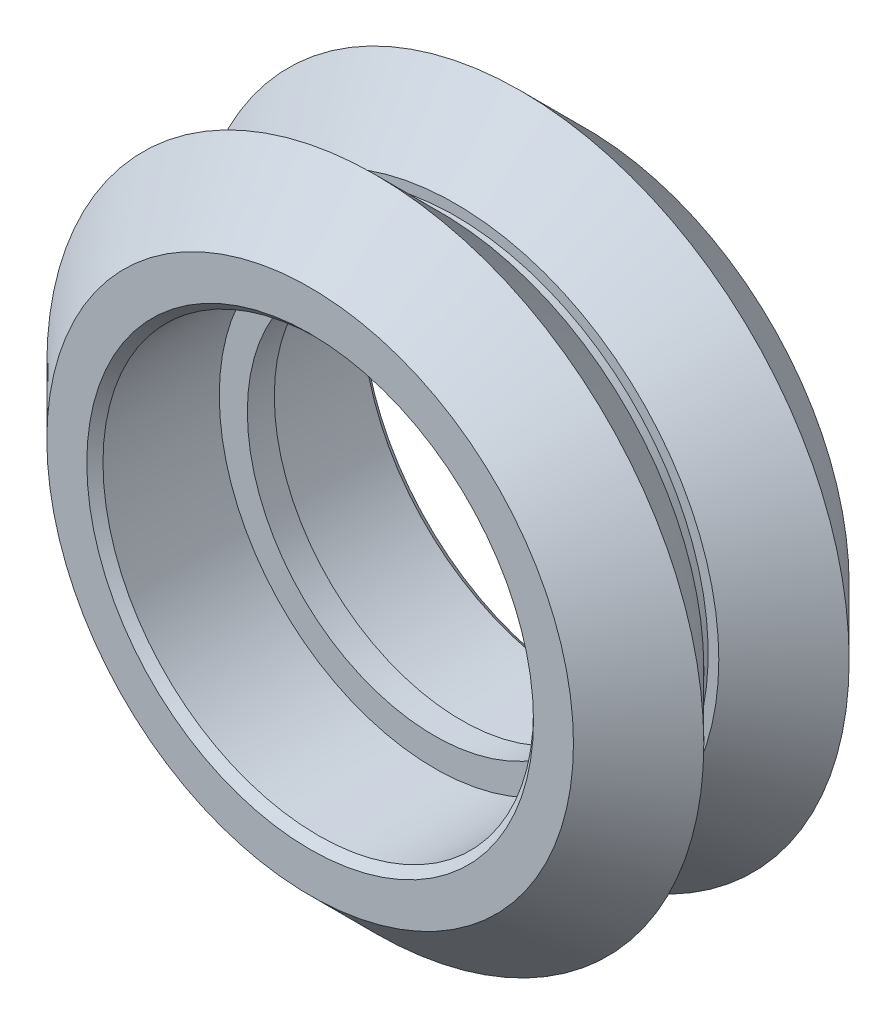
ISO-10303-21;
HEADER;
FILE_DESCRIPTION(('STEP AP214'),'2;1');
FILE_NAME('part.step','',(''),(''),'','','');
FILE_SCHEMA(('AUTOMOTIVE_DESIGN { 1 0 10303 214 1 1 1 1 }'));
ENDSEC;
DATA;
#1=APPLICATION_CONTEXT('core data for automotive mechanical design processes');
#2=APPLICATION_PROTOCOL_DEFINITION('international standard','automotive_design',2000,#1);
#3=PRODUCT_CONTEXT('',#1,'mechanical');
#4=PRODUCT('Part','Part','',(#3));
#5=PRODUCT_RELATED_PRODUCT_CATEGORY('part','',(#4));
#6=PRODUCT_DEFINITION_FORMATION('','',#4);
#7=PRODUCT_DEFINITION_CONTEXT('part definition',#1,'design');
#8=PRODUCT_DEFINITION('design','',#6,#7);
#9=PRODUCT_DEFINITION_SHAPE('','',#8);
#10=(LENGTH_UNIT() NAMED_UNIT(*) SI_UNIT(.MILLI.,.METRE.));
#11=(NAMED_UNIT(*) PLANE_ANGLE_UNIT() SI_UNIT($,.RADIAN.));
#12=(NAMED_UNIT(*) SI_UNIT($,.STERADIAN.) SOLID_ANGLE_UNIT());
#13=UNCERTAINTY_MEASURE_WITH_UNIT(LENGTH_MEASURE(1.E-05),#10,'distance_accuracy_value','');
#14=(GEOMETRIC_REPRESENTATION_CONTEXT(3) GLOBAL_UNCERTAINTY_ASSIGNED_CONTEXT((#13)) GLOBAL_UNIT_ASSIGNED_CONTEXT((#10,
#11,#12)) REPRESENTATION_CONTEXT('',''));
#15=CARTESIAN_POINT('',(0.,0.,0.));
#16=DIRECTION('',(0.,0.,1.));
#17=DIRECTION('',(1.,0.,0.));
#18=AXIS2_PLACEMENT_3D('',#15,#16,#17);
#19=CARTESIAN_POINT('',(0.,0.,-5.115));
#20=DIRECTION('',(0.,0.,-1.));
#21=DIRECTION('',(-1.,0.,0.));
#22=AXIS2_PLACEMENT_3D('',#19,#20,#21);
#23=CYLINDRICAL_SURFACE('',#22,7.987);
#24=CARTESIAN_POINT('',(0.,0.,4.815));
#25=DIRECTION('',(0.,0.,1.));
#26=DIRECTION('',(1.,0.,0.));
#27=AXIS2_PLACEMENT_3D('',#24,#25,#26);
#28=CIRCLE('',#27,7.987);
#29=CARTESIAN_POINT('',(7.987,0.,4.815));
#30=VERTEX_POINT('',#29);
#31=EDGE_CURVE('E42',#30,#30,#28,.T.);
#32=ORIENTED_EDGE('',*,*,#31,.T.);
#33=EDGE_LOOP('',(#32));
#34=FACE_BOUND('',#33,.T.);
#35=CARTESIAN_POINT('',(0.,0.,0.5));
#36=DIRECTION('',(0.,0.,-1.));
#37=DIRECTION('',(-1.,0.,0.));
#38=AXIS2_PLACEMENT_3D('',#35,#36,#37);
#39=CIRCLE('',#38,7.987);
#40=CARTESIAN_POINT('',(-7.987,0.,0.5));
#41=VERTEX_POINT('',#40);
#42=EDGE_CURVE('E51',#41,#41,#39,.T.);
#43=ORIENTED_EDGE('',*,*,#42,.T.);
#44=EDGE_LOOP('',(#43));
#45=FACE_BOUND('',#44,.T.);
#46=ADVANCED_FACE('F31',(#34,#45),#23,.F.);
#47=CARTESIAN_POINT('',(0.,0.,0.5));
#48=DIRECTION('',(0.,0.,-1.));
#49=DIRECTION('',(-1.,0.,0.));
#50=AXIS2_PLACEMENT_3D('',#47,#48,#49);
#51=PLANE('',#50);
#52=ORIENTED_EDGE('',*,*,#42,.F.);
#53=EDGE_LOOP('',(#52));
#54=FACE_BOUND('',#53,.T.);
#55=CARTESIAN_POINT('',(0.,0.,0.5));
#56=DIRECTION('',(0.,0.,-1.));
#57=DIRECTION('',(-1.,0.,0.));
#58=AXIS2_PLACEMENT_3D('',#55,#56,#57);
#59=CIRCLE('',#58,6.945);
#60=CARTESIAN_POINT('',(-6.945,0.,0.5));
#61=VERTEX_POINT('',#60);
#62=EDGE_CURVE('E54',#61,#61,#59,.T.);
#63=ORIENTED_EDGE('',*,*,#62,.T.);
#64=EDGE_LOOP('',(#63));
#65=FACE_BOUND('',#64,.T.);
#66=ADVANCED_FACE('F104',(#54,#65),#51,.F.);
#67=CARTESIAN_POINT('',(0.,0.,-5.115));
#68=DIRECTION('',(0.,0.,-1.));
#69=DIRECTION('',(-1.,0.,0.));
#70=AXIS2_PLACEMENT_3D('',#67,#68,#69);
#71=CYLINDRICAL_SURFACE('',#70,6.945);
#72=ORIENTED_EDGE('',*,*,#62,.F.);
#73=EDGE_LOOP('',(#72));
#74=FACE_BOUND('',#73,.T.);
#75=CARTESIAN_POINT('',(0.,0.,-0.5));
#76=DIRECTION('',(0.,0.,-1.));
#77=DIRECTION('',(-1.,0.,0.));
#78=AXIS2_PLACEMENT_3D('',#75,#76,#77);
#79=CIRCLE('',#78,6.945);
#80=CARTESIAN_POINT('',(-6.945,0.,-0.5));
#81=VERTEX_POINT('',#80);
#82=EDGE_CURVE('E57',#81,#81,#79,.T.);
#83=ORIENTED_EDGE('',*,*,#82,.T.);
#84=EDGE_LOOP('',(#83));
#85=FACE_BOUND('',#84,.T.);
#86=ADVANCED_FACE('F110',(#74,#85),#71,.F.);
#87=CARTESIAN_POINT('',(0.,0.,-0.5));
#88=DIRECTION('',(0.,0.,1.));
#89=DIRECTION('',(1.,0.,0.));
#90=AXIS2_PLACEMENT_3D('',#87,#88,#89);
#91=PLANE('',#90);
#92=ORIENTED_EDGE('',*,*,#82,.F.);
#93=EDGE_LOOP('',(#92));
#94=FACE_BOUND('',#93,.T.);
#95=CARTESIAN_POINT('',(0.,0.,-0.5));
#96=DIRECTION('',(0.,0.,-1.));
#97=DIRECTION('',(-1.,0.,0.));
#98=AXIS2_PLACEMENT_3D('',#95,#96,#97);
#99=CIRCLE('',#98,7.987);
#100=CARTESIAN_POINT('',(-7.987,0.,-0.5));
#101=VERTEX_POINT('',#100);
#102=EDGE_CURVE('E60',#101,#101,#99,.T.);
#103=ORIENTED_EDGE('',*,*,#102,.T.);
#104=EDGE_LOOP('',(#103));
#105=FACE_BOUND('',#104,.T.);
#106=ADVANCED_FACE('F117',(#94,#105),#91,.F.);
#107=CARTESIAN_POINT('',(0.,0.,-5.115));
#108=DIRECTION('',(0.,0.,-1.));
#109=DIRECTION('',(-1.,0.,0.));
#110=AXIS2_PLACEMENT_3D('',#107,#108,#109);
#111=CYLINDRICAL_SURFACE('',#110,7.987);
#112=CARTESIAN_POINT('',(0.,0.,-4.815));
#113=DIRECTION('',(0.,0.,-1.));
#114=DIRECTION('',(-1.,0.,0.));
#115=AXIS2_PLACEMENT_3D('',#112,#113,#114);
#116=CIRCLE('',#115,7.987);
#117=CARTESIAN_POINT('',(-7.987,0.,-4.815));
#118=VERTEX_POINT('',#117);
#119=EDGE_CURVE('E38',#118,#118,#116,.T.);
#120=ORIENTED_EDGE('',*,*,#119,.T.);
#121=EDGE_LOOP('',(#120));
#122=FACE_BOUND('',#121,.T.);
#123=ORIENTED_EDGE('',*,*,#102,.F.);
#124=EDGE_LOOP('',(#123));
#125=FACE_BOUND('',#124,.T.);
#126=ADVANCED_FACE('F121',(#122,#125),#111,.F.);
#127=CARTESIAN_POINT('',(0.,0.,-5.115));
#128=DIRECTION('',(0.,0.,-1.));
#129=DIRECTION('',(-1.,0.,0.));
#130=AXIS2_PLACEMENT_3D('',#127,#128,#129);
#131=PLANE('',#130);
#132=CARTESIAN_POINT('',(0.,0.,-5.115));
#133=DIRECTION('',(0.,0.,-1.));
#134=DIRECTION('',(-1.,0.,0.));
#135=AXIS2_PLACEMENT_3D('',#132,#133,#134);
#136=CIRCLE('',#135,8.287);
#137=CARTESIAN_POINT('',(-8.287,0.,-5.115));
#138=VERTEX_POINT('',#137);
#139=EDGE_CURVE('E10',#138,#138,#136,.F.);
#140=ORIENTED_EDGE('',*,*,#139,.T.);
#141=EDGE_LOOP('',(#140));
#142=FACE_BOUND('',#141,.T.);
#143=CARTESIAN_POINT('',(0.,0.,-5.115));
#144=DIRECTION('',(0.,0.,-1.));
#145=DIRECTION('',(-1.,0.,0.));
#146=AXIS2_PLACEMENT_3D('',#143,#144,#145);
#147=CIRCLE('',#146,9.77);
#148=CARTESIAN_POINT('',(-9.77,0.,-5.115));
#149=VERTEX_POINT('',#148);
#150=EDGE_CURVE('E63',#149,#149,#147,.T.);
#151=ORIENTED_EDGE('',*,*,#150,.T.);
#152=EDGE_LOOP('',(#151));
#153=FACE_BOUND('',#152,.T.);
#154=ADVANCED_FACE('F125',(#142,#153),#131,.T.);
#155=CARTESIAN_POINT('',(0.,0.,-5.115));
#156=DIRECTION('',(0.,0.,1.));
#157=DIRECTION('',(1.,0.,0.));
#158=AXIS2_PLACEMENT_3D('',#155,#156,#157);
#159=CONICAL_SURFACE('',#158,9.77,0.785398163397449);
#160=CARTESIAN_POINT('',(0.,0.,-2.69669480834201));
#161=DIRECTION('',(0.,0.,-1.));
#162=DIRECTION('',(-1.,0.,0.));
#163=AXIS2_PLACEMENT_3D('',#160,#161,#162);
#164=CIRCLE('',#163,12.188305191658);
#165=CARTESIAN_POINT('',(-12.188305191658,0.,-2.69669480834201));
#166=VERTEX_POINT('',#165);
#167=EDGE_CURVE('E66',#166,#166,#164,.T.);
#168=ORIENTED_EDGE('',*,*,#167,.T.);
#169=EDGE_LOOP('',(#168));
#170=FACE_BOUND('',#169,.T.);
#171=ORIENTED_EDGE('',*,*,#150,.F.);
#172=EDGE_LOOP('',(#171));
#173=FACE_BOUND('',#172,.T.);
#174=ADVANCED_FACE('F128',(#170,#173),#159,.T.);
#175=CARTESIAN_POINT('',(0.,0.,-2.69669480834201));
#176=DIRECTION('',(0.,0.,-1.));
#177=DIRECTION('',(-1.,0.,0.));
#178=AXIS2_PLACEMENT_3D('',#175,#176,#177);
#179=CONICAL_SURFACE('',#178,12.188305191658,0.78539816339745);
#180=CARTESIAN_POINT('',(0.,0.,-0.278389616684021));
#181=DIRECTION('',(0.,0.,-1.));
#182=DIRECTION('',(-1.,0.,0.));
#183=AXIS2_PLACEMENT_3D('',#180,#181,#182);
#184=CIRCLE('',#183,9.77);
#185=CARTESIAN_POINT('',(-9.77,0.,-0.278389616684021));
#186=VERTEX_POINT('',#185);
#187=EDGE_CURVE('E69',#186,#186,#184,.T.);
#188=ORIENTED_EDGE('',*,*,#187,.T.);
#189=EDGE_LOOP('',(#188));
#190=FACE_BOUND('',#189,.T.);
#191=ORIENTED_EDGE('',*,*,#167,.F.);
#192=EDGE_LOOP('',(#191));
#193=FACE_BOUND('',#192,.T.);
#194=ADVANCED_FACE('F131',(#190,#193),#179,.T.);
#195=CARTESIAN_POINT('',(0.,0.,-0.278389616684021));
#196=DIRECTION('',(0.,0.,1.));
#197=DIRECTION('',(1.,0.,0.));
#198=AXIS2_PLACEMENT_3D('',#195,#196,#197);
#199=PLANE('',#198);
#200=CARTESIAN_POINT('',(0.,0.,-0.278389616684021));
#201=DIRECTION('',(0.,0.,-1.));
#202=DIRECTION('',(-1.,0.,0.));
#203=AXIS2_PLACEMENT_3D('',#200,#201,#202);
#204=CIRCLE('',#203,9.375);
#205=CARTESIAN_POINT('',(-9.375,0.,-0.278389616684021));
#206=VERTEX_POINT('',#205);
#207=EDGE_CURVE('E72',#206,#206,#204,.T.);
#208=ORIENTED_EDGE('',*,*,#207,.T.);
#209=EDGE_LOOP('',(#208));
#210=FACE_BOUND('',#209,.T.);
#211=ORIENTED_EDGE('',*,*,#187,.F.);
#212=EDGE_LOOP('',(#211));
#213=FACE_BOUND('',#212,.T.);
#214=ADVANCED_FACE('F135',(#210,#213),#199,.T.);
#215=CARTESIAN_POINT('',(0.,0.,-5.115));
#216=DIRECTION('',(0.,0.,-1.));
#217=DIRECTION('',(-1.,0.,0.));
#218=AXIS2_PLACEMENT_3D('',#215,#216,#217);
#219=CYLINDRICAL_SURFACE('',#218,9.375);
#220=CARTESIAN_POINT('',(0.,0.,0.278389616684021));
#221=DIRECTION('',(0.,0.,-1.));
#222=DIRECTION('',(-1.,0.,0.));
#223=AXIS2_PLACEMENT_3D('',#220,#221,#222);
#224=CIRCLE('',#223,9.375);
#225=CARTESIAN_POINT('',(-9.375,0.,0.278389616684021));
#226=VERTEX_POINT('',#225);
#227=EDGE_CURVE('E75',#226,#226,#224,.T.);
#228=ORIENTED_EDGE('',*,*,#227,.T.);
#229=EDGE_LOOP('',(#228));
#230=FACE_BOUND('',#229,.T.);
#231=ORIENTED_EDGE('',*,*,#207,.F.);
#232=EDGE_LOOP('',(#231));
#233=FACE_BOUND('',#232,.T.);
#234=ADVANCED_FACE('F139',(#230,#233),#219,.T.);
#235=CARTESIAN_POINT('',(0.,0.,0.278389616684021));
#236=DIRECTION('',(0.,0.,-1.));
#237=DIRECTION('',(-1.,0.,0.));
#238=AXIS2_PLACEMENT_3D('',#235,#236,#237);
#239=PLANE('',#238);
#240=CARTESIAN_POINT('',(0.,0.,0.278389616684021));
#241=DIRECTION('',(0.,0.,-1.));
#242=DIRECTION('',(-1.,0.,0.));
#243=AXIS2_PLACEMENT_3D('',#240,#241,#242);
#244=CIRCLE('',#243,9.77);
#245=CARTESIAN_POINT('',(-9.77,0.,0.278389616684021));
#246=VERTEX_POINT('',#245);
#247=EDGE_CURVE('E78',#246,#246,#244,.T.);
#248=ORIENTED_EDGE('',*,*,#247,.T.);
#249=EDGE_LOOP('',(#248));
#250=FACE_BOUND('',#249,.T.);
#251=ORIENTED_EDGE('',*,*,#227,.F.);
#252=EDGE_LOOP('',(#251));
#253=FACE_BOUND('',#252,.T.);
#254=ADVANCED_FACE('F143',(#250,#253),#239,.T.);
#255=CARTESIAN_POINT('',(0.,0.,0.278389616684021));
#256=DIRECTION('',(0.,0.,1.));
#257=DIRECTION('',(1.,0.,0.));
#258=AXIS2_PLACEMENT_3D('',#255,#256,#257);
#259=CONICAL_SURFACE('',#258,9.77,0.78539816339745);
#260=CARTESIAN_POINT('',(0.,0.,2.69669480834201));
#261=DIRECTION('',(0.,0.,-1.));
#262=DIRECTION('',(-1.,0.,0.));
#263=AXIS2_PLACEMENT_3D('',#260,#261,#262);
#264=CIRCLE('',#263,12.188305191658);
#265=CARTESIAN_POINT('',(-12.188305191658,0.,2.69669480834201));
#266=VERTEX_POINT('',#265);
#267=EDGE_CURVE('E81',#266,#266,#264,.T.);
#268=ORIENTED_EDGE('',*,*,#267,.T.);
#269=EDGE_LOOP('',(#268));
#270=FACE_BOUND('',#269,.T.);
#271=ORIENTED_EDGE('',*,*,#247,.F.);
#272=EDGE_LOOP('',(#271));
#273=FACE_BOUND('',#272,.T.);
#274=ADVANCED_FACE('F101',(#270,#273),#259,.T.);
#275=CARTESIAN_POINT('',(0.,0.,2.69669480834201));
#276=DIRECTION('',(0.,0.,-1.));
#277=DIRECTION('',(-1.,0.,0.));
#278=AXIS2_PLACEMENT_3D('',#275,#276,#277);
#279=CONICAL_SURFACE('',#278,12.188305191658,0.785398163397449);
#280=CARTESIAN_POINT('',(0.,0.,5.115));
#281=DIRECTION('',(0.,0.,-1.));
#282=DIRECTION('',(-1.,0.,0.));
#283=AXIS2_PLACEMENT_3D('',#280,#281,#282);
#284=CIRCLE('',#283,9.77);
#285=CARTESIAN_POINT('',(-9.77,0.,5.115));
#286=VERTEX_POINT('',#285);
#287=EDGE_CURVE('E84',#286,#286,#284,.T.);
#288=ORIENTED_EDGE('',*,*,#287,.T.);
#289=EDGE_LOOP('',(#288));
#290=FACE_BOUND('',#289,.T.);
#291=ORIENTED_EDGE('',*,*,#267,.F.);
#292=EDGE_LOOP('',(#291));
#293=FACE_BOUND('',#292,.T.);
#294=ADVANCED_FACE('F88',(#290,#293),#279,.T.);
#295=CARTESIAN_POINT('',(0.,0.,5.115));
#296=DIRECTION('',(0.,0.,1.));
#297=DIRECTION('',(1.,0.,0.));
#298=AXIS2_PLACEMENT_3D('',#295,#296,#297);
#299=PLANE('',#298);
#300=CARTESIAN_POINT('',(0.,0.,5.115));
#301=DIRECTION('',(0.,0.,1.));
#302=DIRECTION('',(1.,0.,0.));
#303=AXIS2_PLACEMENT_3D('',#300,#301,#302);
#304=CIRCLE('',#303,8.28699999999999);
#305=CARTESIAN_POINT('',(8.28699999999999,0.,5.115));
#306=VERTEX_POINT('',#305);
#307=EDGE_CURVE('E46',#306,#306,#304,.F.);
#308=ORIENTED_EDGE('',*,*,#307,.T.);
#309=EDGE_LOOP('',(#308));
#310=FACE_BOUND('',#309,.T.);
#311=ORIENTED_EDGE('',*,*,#287,.F.);
#312=EDGE_LOOP('',(#311));
#313=FACE_BOUND('',#312,.T.);
#314=ADVANCED_FACE('F91',(#310,#313),#299,.T.);
#315=CARTESIAN_POINT('',(0.,0.,5.115));
#316=DIRECTION('',(0.,0.,1.));
#317=DIRECTION('',(1.,0.,0.));
#318=AXIS2_PLACEMENT_3D('',#315,#316,#317);
#319=CONICAL_SURFACE('',#318,8.28699999999999,0.78539816339744);
#320=ORIENTED_EDGE('',*,*,#31,.F.);
#321=EDGE_LOOP('',(#320));
#322=FACE_BOUND('',#321,.T.);
#323=ORIENTED_EDGE('',*,*,#307,.F.);
#324=EDGE_LOOP('',(#323));
#325=FACE_BOUND('',#324,.T.);
#326=ADVANCED_FACE('F93',(#322,#325),#319,.F.);
#327=CARTESIAN_POINT('',(0.,0.,-4.815));
#328=DIRECTION('',(0.,0.,-1.));
#329=DIRECTION('',(-1.,0.,0.));
#330=AXIS2_PLACEMENT_3D('',#327,#328,#329);
#331=CONICAL_SURFACE('',#330,7.987,0.785398163397454);
#332=ORIENTED_EDGE('',*,*,#139,.F.);
#333=EDGE_LOOP('',(#332));
#334=FACE_BOUND('',#333,.T.);
#335=ORIENTED_EDGE('',*,*,#119,.F.);
#336=EDGE_LOOP('',(#335));
#337=FACE_BOUND('',#336,.T.);
#338=ADVANCED_FACE('F33',(#334,#337),#331,.F.);
#339=CLOSED_SHELL('',(#46,#66,#86,#106,#126,#154,#174,#194,#214,#234,#254,#274,#294,#314,#326,#338));
#340=MANIFOLD_SOLID_BREP('B2',#339);
#341=ADVANCED_BREP_SHAPE_REPRESENTATION('',(#18,#340),#14);
#342=SHAPE_DEFINITION_REPRESENTATION(#9,#341);
ENDSEC;
END-ISO-10303-21;
